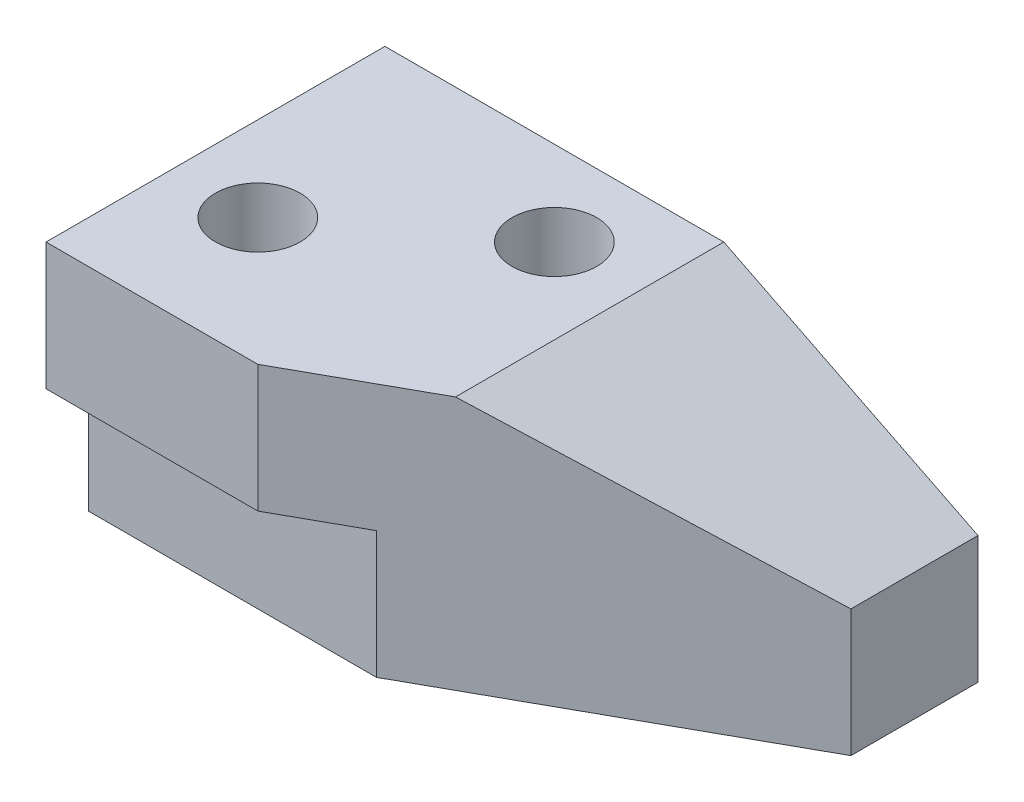
ISO-10303-21;
HEADER;
FILE_DESCRIPTION(('STEP AP214'),'2;1');
FILE_NAME('part.step','',(''),(''),'','','');
FILE_SCHEMA(('AUTOMOTIVE_DESIGN { 1 0 10303 214 1 1 1 1 }'));
ENDSEC;
DATA;
#1=APPLICATION_CONTEXT('core data for automotive mechanical design processes');
#2=APPLICATION_PROTOCOL_DEFINITION('international standard','automotive_design',2000,#1);
#3=PRODUCT_CONTEXT('',#1,'mechanical');
#4=PRODUCT('Part','Part','',(#3));
#5=PRODUCT_RELATED_PRODUCT_CATEGORY('part','',(#4));
#6=PRODUCT_DEFINITION_FORMATION('','',#4);
#7=PRODUCT_DEFINITION_CONTEXT('part definition',#1,'design');
#8=PRODUCT_DEFINITION('design','',#6,#7);
#9=PRODUCT_DEFINITION_SHAPE('','',#8);
#10=(LENGTH_UNIT() NAMED_UNIT(*) SI_UNIT(.MILLI.,.METRE.));
#11=(NAMED_UNIT(*) PLANE_ANGLE_UNIT() SI_UNIT($,.RADIAN.));
#12=(NAMED_UNIT(*) SI_UNIT($,.STERADIAN.) SOLID_ANGLE_UNIT());
#13=UNCERTAINTY_MEASURE_WITH_UNIT(LENGTH_MEASURE(1.E-05),#10,'distance_accuracy_value','');
#14=(GEOMETRIC_REPRESENTATION_CONTEXT(3) GLOBAL_UNCERTAINTY_ASSIGNED_CONTEXT((#13)) GLOBAL_UNIT_ASSIGNED_CONTEXT((#10,
#11,#12)) REPRESENTATION_CONTEXT('',''));
#15=CARTESIAN_POINT('',(0.,0.,0.));
#16=DIRECTION('',(0.,0.,1.));
#17=DIRECTION('',(1.,0.,0.));
#18=AXIS2_PLACEMENT_3D('',#15,#16,#17);
#19=CARTESIAN_POINT('',(0.,30.,0.));
#20=DIRECTION('',(1.,0.,0.));
#21=DIRECTION('',(0.,0.,-1.));
#22=AXIS2_PLACEMENT_3D('',#19,#20,#21);
#23=PLANE('',#22);
#24=DIRECTION('',(0.,0.,1.));
#25=VECTOR('',#24,1.);
#26=CARTESIAN_POINT('',(0.,0.,0.));
#27=LINE('',#26,#25);
#28=CARTESIAN_POINT('',(0.,0.,-40.));
#29=VERTEX_POINT('',#28);
#30=CARTESIAN_POINT('',(0.,0.,-5.));
#31=VERTEX_POINT('',#30);
#32=EDGE_CURVE('E162',#29,#31,#27,.T.);
#33=ORIENTED_EDGE('',*,*,#32,.T.);
#34=DIRECTION('',(0.,-1.,0.));
#35=VECTOR('',#34,1.);
#36=CARTESIAN_POINT('',(0.,0.,-5.));
#37=LINE('',#36,#35);
#38=CARTESIAN_POINT('',(0.,15.,-5.));
#39=VERTEX_POINT('',#38);
#40=EDGE_CURVE('E113',#39,#31,#37,.T.);
#41=ORIENTED_EDGE('',*,*,#40,.F.);
#42=DIRECTION('',(0.,0.,-1.));
#43=VECTOR('',#42,1.);
#44=CARTESIAN_POINT('',(0.,15.,0.));
#45=LINE('',#44,#43);
#46=CARTESIAN_POINT('',(0.,15.,0.));
#47=VERTEX_POINT('',#46);
#48=EDGE_CURVE('E105',#47,#39,#45,.T.);
#49=ORIENTED_EDGE('',*,*,#48,.F.);
#50=DIRECTION('',(0.,-1.,0.));
#51=VECTOR('',#50,1.);
#52=CARTESIAN_POINT('',(0.,30.,0.));
#53=LINE('',#52,#51);
#54=CARTESIAN_POINT('',(0.,30.,0.));
#55=VERTEX_POINT('',#54);
#56=EDGE_CURVE('E119',#55,#47,#53,.T.);
#57=ORIENTED_EDGE('',*,*,#56,.F.);
#58=DIRECTION('',(0.,0.,1.));
#59=VECTOR('',#58,1.);
#60=CARTESIAN_POINT('',(0.,30.,0.));
#61=LINE('',#60,#59);
#62=CARTESIAN_POINT('',(0.,30.,-40.));
#63=VERTEX_POINT('',#62);
#64=EDGE_CURVE('E166',#63,#55,#61,.T.);
#65=ORIENTED_EDGE('',*,*,#64,.F.);
#66=DIRECTION('',(0.,-1.,0.));
#67=VECTOR('',#66,1.);
#68=CARTESIAN_POINT('',(0.,30.,-40.));
#69=LINE('',#68,#67);
#70=EDGE_CURVE('E135',#63,#29,#69,.T.);
#71=ORIENTED_EDGE('',*,*,#70,.T.);
#72=EDGE_LOOP('',(#33,#41,#49,#57,#65,#71));
#73=FACE_BOUND('',#72,.T.);
#74=ADVANCED_FACE('F39',(#73),#23,.F.);
#75=CARTESIAN_POINT('',(0.,30.,0.));
#76=DIRECTION('',(0.,0.,-1.));
#77=DIRECTION('',(-1.,0.,0.));
#78=AXIS2_PLACEMENT_3D('',#75,#76,#77);
#79=PLANE('',#78);
#80=ORIENTED_EDGE('',*,*,#56,.T.);
#81=DIRECTION('',(-1.,0.,0.));
#82=VECTOR('',#81,1.);
#83=CARTESIAN_POINT('',(70.,15.,0.));
#84=LINE('',#83,#82);
#85=CARTESIAN_POINT('',(25.,15.,0.));
#86=VERTEX_POINT('',#85);
#87=EDGE_CURVE('E102',#86,#47,#84,.T.);
#88=ORIENTED_EDGE('',*,*,#87,.F.);
#89=DIRECTION('',(0.,-1.,0.));
#90=VECTOR('',#89,1.);
#91=CARTESIAN_POINT('',(25.,30.,0.));
#92=LINE('',#91,#90);
#93=CARTESIAN_POINT('',(25.,30.,0.));
#94=VERTEX_POINT('',#93);
#95=EDGE_CURVE('E141',#94,#86,#92,.T.);
#96=ORIENTED_EDGE('',*,*,#95,.F.);
#97=DIRECTION('',(1.,0.,0.));
#98=VECTOR('',#97,1.);
#99=CARTESIAN_POINT('',(0.,30.,0.));
#100=LINE('',#99,#98);
#101=EDGE_CURVE('E125',#55,#94,#100,.T.);
#102=ORIENTED_EDGE('',*,*,#101,.F.);
#103=EDGE_LOOP('',(#80,#88,#96,#102));
#104=FACE_BOUND('',#103,.T.);
#105=ADVANCED_FACE('F123',(#104),#79,.F.);
#106=CARTESIAN_POINT('',(70.,30.,0.));
#107=DIRECTION('',(-1.,0.,0.));
#108=DIRECTION('',(0.,0.,1.));
#109=AXIS2_PLACEMENT_3D('',#106,#107,#108);
#110=PLANE('',#109);
#111=DIRECTION('',(0.,0.,1.));
#112=VECTOR('',#111,1.);
#113=CARTESIAN_POINT('',(70.,15.,-40.));
#114=LINE('',#113,#112);
#115=CARTESIAN_POINT('',(70.,15.,-40.));
#116=VERTEX_POINT('',#115);
#117=CARTESIAN_POINT('',(70.,15.,-25.));
#118=VERTEX_POINT('',#117);
#119=EDGE_CURVE('E158',#116,#118,#114,.T.);
#120=ORIENTED_EDGE('',*,*,#119,.T.);
#121=DIRECTION('',(0.,-1.,0.));
#122=VECTOR('',#121,1.);
#123=CARTESIAN_POINT('',(70.,30.,-25.));
#124=LINE('',#123,#122);
#125=CARTESIAN_POINT('',(70.,0.,-25.));
#126=VERTEX_POINT('',#125);
#127=EDGE_CURVE('E62',#118,#126,#124,.T.);
#128=ORIENTED_EDGE('',*,*,#127,.T.);
#129=DIRECTION('',(0.,0.,-1.));
#130=VECTOR('',#129,1.);
#131=CARTESIAN_POINT('',(70.,0.,0.));
#132=LINE('',#131,#130);
#133=CARTESIAN_POINT('',(70.,0.,-40.));
#134=VERTEX_POINT('',#133);
#135=EDGE_CURVE('E177',#126,#134,#132,.T.);
#136=ORIENTED_EDGE('',*,*,#135,.T.);
#137=DIRECTION('',(0.,-1.,0.));
#138=VECTOR('',#137,1.);
#139=CARTESIAN_POINT('',(70.,30.,-40.));
#140=LINE('',#139,#138);
#141=EDGE_CURVE('E129',#116,#134,#140,.T.);
#142=ORIENTED_EDGE('',*,*,#141,.F.);
#143=EDGE_LOOP('',(#120,#128,#136,#142));
#144=FACE_BOUND('',#143,.T.);
#145=ADVANCED_FACE('F238',(#144),#110,.F.);
#146=CARTESIAN_POINT('',(0.,30.,-40.));
#147=DIRECTION('',(0.,0.,1.));
#148=DIRECTION('',(1.,0.,0.));
#149=AXIS2_PLACEMENT_3D('',#146,#147,#148);
#150=PLANE('',#149);
#151=DIRECTION('',(-1.,0.,0.));
#152=VECTOR('',#151,1.);
#153=CARTESIAN_POINT('',(0.,30.,-40.));
#154=LINE('',#153,#152);
#155=CARTESIAN_POINT('',(40.,30.,-40.));
#156=VERTEX_POINT('',#155);
#157=EDGE_CURVE('E172',#156,#63,#154,.T.);
#158=ORIENTED_EDGE('',*,*,#157,.F.);
#159=DIRECTION('',(0.894427190999916,-0.447213595499958,0.));
#160=VECTOR('',#159,1.);
#161=CARTESIAN_POINT('',(40.,30.,-40.));
#162=LINE('',#161,#160);
#163=EDGE_CURVE('E148',#156,#116,#162,.T.);
#164=ORIENTED_EDGE('',*,*,#163,.T.);
#165=ORIENTED_EDGE('',*,*,#141,.T.);
#166=DIRECTION('',(-1.,0.,0.));
#167=VECTOR('',#166,1.);
#168=CARTESIAN_POINT('',(0.,0.,-40.));
#169=LINE('',#168,#167);
#170=EDGE_CURVE('E169',#134,#29,#169,.T.);
#171=ORIENTED_EDGE('',*,*,#170,.T.);
#172=ORIENTED_EDGE('',*,*,#70,.F.);
#173=EDGE_LOOP('',(#158,#164,#165,#171,#172));
#174=FACE_BOUND('',#173,.T.);
#175=ADVANCED_FACE('F230',(#174),#150,.F.);
#176=CARTESIAN_POINT('',(0.,30.,0.));
#177=DIRECTION('',(0.,-1.,0.));
#178=DIRECTION('',(0.,0.,-1.));
#179=AXIS2_PLACEMENT_3D('',#176,#177,#178);
#180=PLANE('',#179);
#181=CARTESIAN_POINT('',(30.,30.,-30.));
#182=DIRECTION('',(0.,1.,0.));
#183=DIRECTION('',(0.,0.,1.));
#184=AXIS2_PLACEMENT_3D('',#181,#182,#183);
#185=CIRCLE('',#184,5.);
#186=CARTESIAN_POINT('',(30.,30.,-25.));
#187=VERTEX_POINT('',#186);
#188=EDGE_CURVE('E210',#187,#187,#185,.T.);
#189=ORIENTED_EDGE('',*,*,#188,.F.);
#190=EDGE_LOOP('',(#189));
#191=FACE_BOUND('',#190,.T.);
#192=CARTESIAN_POINT('',(10.,30.,-15.));
#193=DIRECTION('',(0.,1.,0.));
#194=DIRECTION('',(0.,0.,1.));
#195=AXIS2_PLACEMENT_3D('',#192,#193,#194);
#196=CIRCLE('',#195,5.);
#197=CARTESIAN_POINT('',(10.,30.,-10.));
#198=VERTEX_POINT('',#197);
#199=EDGE_CURVE('E202',#198,#198,#196,.T.);
#200=ORIENTED_EDGE('',*,*,#199,.F.);
#201=EDGE_LOOP('',(#200));
#202=FACE_BOUND('',#201,.T.);
#203=ORIENTED_EDGE('',*,*,#101,.T.);
#204=DIRECTION('',(0.874157276121538,0.,-0.485642931178632));
#205=VECTOR('',#204,1.);
#206=CARTESIAN_POINT('',(25.,30.,0.));
#207=LINE('',#206,#205);
#208=CARTESIAN_POINT('',(40.,30.,-8.33333333333334));
#209=VERTEX_POINT('',#208);
#210=EDGE_CURVE('E143',#94,#209,#207,.T.);
#211=ORIENTED_EDGE('',*,*,#210,.T.);
#212=DIRECTION('',(0.,0.,1.));
#213=VECTOR('',#212,1.);
#214=CARTESIAN_POINT('',(40.,30.,-40.));
#215=LINE('',#214,#213);
#216=EDGE_CURVE('E157',#156,#209,#215,.T.);
#217=ORIENTED_EDGE('',*,*,#216,.F.);
#218=ORIENTED_EDGE('',*,*,#157,.T.);
#219=ORIENTED_EDGE('',*,*,#64,.T.);
#220=EDGE_LOOP('',(#203,#211,#217,#218,#219));
#221=FACE_BOUND('',#220,.T.);
#222=ADVANCED_FACE('F227',(#191,#202,#221),#180,.F.);
#223=CARTESIAN_POINT('',(0.,0.,0.));
#224=DIRECTION('',(0.,-1.,0.));
#225=DIRECTION('',(0.,0.,-1.));
#226=AXIS2_PLACEMENT_3D('',#223,#224,#225);
#227=PLANE('',#226);
#228=CARTESIAN_POINT('',(30.,0.,-30.));
#229=DIRECTION('',(0.,1.,0.));
#230=DIRECTION('',(0.,0.,1.));
#231=AXIS2_PLACEMENT_3D('',#228,#229,#230);
#232=CIRCLE('',#231,5.);
#233=CARTESIAN_POINT('',(30.,0.,-25.));
#234=VERTEX_POINT('',#233);
#235=EDGE_CURVE('E206',#234,#234,#232,.T.);
#236=ORIENTED_EDGE('',*,*,#235,.T.);
#237=EDGE_LOOP('',(#236));
#238=FACE_BOUND('',#237,.T.);
#239=CARTESIAN_POINT('',(10.,0.,-15.));
#240=DIRECTION('',(0.,1.,0.));
#241=DIRECTION('',(0.,0.,1.));
#242=AXIS2_PLACEMENT_3D('',#239,#240,#241);
#243=CIRCLE('',#242,5.);
#244=CARTESIAN_POINT('',(10.,0.,-10.));
#245=VERTEX_POINT('',#244);
#246=EDGE_CURVE('E121',#245,#245,#243,.T.);
#247=ORIENTED_EDGE('',*,*,#246,.T.);
#248=EDGE_LOOP('',(#247));
#249=FACE_BOUND('',#248,.T.);
#250=DIRECTION('',(-1.,0.,0.));
#251=VECTOR('',#250,1.);
#252=CARTESIAN_POINT('',(70.,0.,-5.));
#253=LINE('',#252,#251);
#254=CARTESIAN_POINT('',(34.,0.,-5.));
#255=VERTEX_POINT('',#254);
#256=EDGE_CURVE('E192',#255,#31,#253,.T.);
#257=ORIENTED_EDGE('',*,*,#256,.T.);
#258=ORIENTED_EDGE('',*,*,#32,.F.);
#259=ORIENTED_EDGE('',*,*,#170,.F.);
#260=ORIENTED_EDGE('',*,*,#135,.F.);
#261=DIRECTION('',(0.874157276121538,0.,-0.485642931178632));
#262=VECTOR('',#261,1.);
#263=CARTESIAN_POINT('',(25.,0.,0.));
#264=LINE('',#263,#262);
#265=EDGE_CURVE('E150',#255,#126,#264,.T.);
#266=ORIENTED_EDGE('',*,*,#265,.F.);
#267=EDGE_LOOP('',(#257,#258,#259,#260,#266));
#268=FACE_BOUND('',#267,.T.);
#269=ADVANCED_FACE('F190',(#238,#249,#268),#227,.T.);
#270=CARTESIAN_POINT('',(40.,30.,-40.));
#271=DIRECTION('',(-0.447213595499958,-0.894427190999916,0.));
#272=DIRECTION('',(0.894427190999916,-0.447213595499958,0.));
#273=AXIS2_PLACEMENT_3D('',#270,#271,#272);
#274=PLANE('',#273);
#275=ORIENTED_EDGE('',*,*,#216,.T.);
#276=DIRECTION('',(0.800989487081973,-0.400494743540986,-0.444994159489985));
#277=VECTOR('',#276,1.);
#278=CARTESIAN_POINT('',(51.2871287128713,24.3564356435643,-14.6039603960396));
#279=LINE('',#278,#277);
#280=EDGE_CURVE('E128',#209,#118,#279,.T.);
#281=ORIENTED_EDGE('',*,*,#280,.T.);
#282=ORIENTED_EDGE('',*,*,#119,.F.);
#283=ORIENTED_EDGE('',*,*,#163,.F.);
#284=EDGE_LOOP('',(#275,#281,#282,#283));
#285=FACE_BOUND('',#284,.T.);
#286=ADVANCED_FACE('F239',(#285),#274,.F.);
#287=CARTESIAN_POINT('',(25.,30.,0.));
#288=DIRECTION('',(-0.485642931178632,0.,-0.874157276121538));
#289=DIRECTION('',(-0.874157276121538,0.,0.485642931178632));
#290=AXIS2_PLACEMENT_3D('',#287,#288,#289);
#291=PLANE('',#290);
#292=DIRECTION('',(0.874157276121538,0.,-0.485642931178632));
#293=VECTOR('',#292,1.);
#294=CARTESIAN_POINT('',(25.,15.,0.));
#295=LINE('',#294,#293);
#296=CARTESIAN_POINT('',(34.,15.,-5.));
#297=VERTEX_POINT('',#296);
#298=EDGE_CURVE('E47',#86,#297,#295,.T.);
#299=ORIENTED_EDGE('',*,*,#298,.T.);
#300=DIRECTION('',(0.,-1.,0.));
#301=VECTOR('',#300,1.);
#302=CARTESIAN_POINT('',(34.,30.,-5.));
#303=LINE('',#302,#301);
#304=EDGE_CURVE('E11',#297,#255,#303,.T.);
#305=ORIENTED_EDGE('',*,*,#304,.T.);
#306=ORIENTED_EDGE('',*,*,#265,.T.);
#307=ORIENTED_EDGE('',*,*,#127,.F.);
#308=ORIENTED_EDGE('',*,*,#280,.F.);
#309=ORIENTED_EDGE('',*,*,#210,.F.);
#310=ORIENTED_EDGE('',*,*,#95,.T.);
#311=EDGE_LOOP('',(#299,#305,#306,#307,#308,#309,#310));
#312=FACE_BOUND('',#311,.T.);
#313=ADVANCED_FACE('F139',(#312),#291,.F.);
#314=CARTESIAN_POINT('',(70.,0.,-5.));
#315=DIRECTION('',(0.,0.,-1.));
#316=DIRECTION('',(-1.,0.,0.));
#317=AXIS2_PLACEMENT_3D('',#314,#315,#316);
#318=PLANE('',#317);
#319=DIRECTION('',(-1.,0.,0.));
#320=VECTOR('',#319,1.);
#321=CARTESIAN_POINT('',(70.,15.,-5.));
#322=LINE('',#321,#320);
#323=EDGE_CURVE('E54',#297,#39,#322,.T.);
#324=ORIENTED_EDGE('',*,*,#323,.T.);
#325=ORIENTED_EDGE('',*,*,#40,.T.);
#326=ORIENTED_EDGE('',*,*,#256,.F.);
#327=ORIENTED_EDGE('',*,*,#304,.F.);
#328=EDGE_LOOP('',(#324,#325,#326,#327));
#329=FACE_BOUND('',#328,.T.);
#330=ADVANCED_FACE('F246',(#329),#318,.F.);
#331=CARTESIAN_POINT('',(70.,15.,0.));
#332=DIRECTION('',(0.,1.,0.));
#333=DIRECTION('',(0.,0.,1.));
#334=AXIS2_PLACEMENT_3D('',#331,#332,#333);
#335=PLANE('',#334);
#336=ORIENTED_EDGE('',*,*,#87,.T.);
#337=ORIENTED_EDGE('',*,*,#48,.T.);
#338=ORIENTED_EDGE('',*,*,#323,.F.);
#339=ORIENTED_EDGE('',*,*,#298,.F.);
#340=EDGE_LOOP('',(#336,#337,#338,#339));
#341=FACE_BOUND('',#340,.T.);
#342=ADVANCED_FACE('F104',(#341),#335,.F.);
#343=CARTESIAN_POINT('',(10.,0.,-15.));
#344=DIRECTION('',(0.,1.,0.));
#345=DIRECTION('',(0.,0.,1.));
#346=AXIS2_PLACEMENT_3D('',#343,#344,#345);
#347=CYLINDRICAL_SURFACE('',#346,5.);
#348=ORIENTED_EDGE('',*,*,#246,.F.);
#349=EDGE_LOOP('',(#348));
#350=FACE_BOUND('',#349,.T.);
#351=ORIENTED_EDGE('',*,*,#199,.T.);
#352=EDGE_LOOP('',(#351));
#353=FACE_BOUND('',#352,.T.);
#354=ADVANCED_FACE('F223',(#350,#353),#347,.F.);
#355=CARTESIAN_POINT('',(30.,0.,-30.));
#356=DIRECTION('',(0.,1.,0.));
#357=DIRECTION('',(0.,0.,1.));
#358=AXIS2_PLACEMENT_3D('',#355,#356,#357);
#359=CYLINDRICAL_SURFACE('',#358,5.);
#360=ORIENTED_EDGE('',*,*,#235,.F.);
#361=EDGE_LOOP('',(#360));
#362=FACE_BOUND('',#361,.T.);
#363=ORIENTED_EDGE('',*,*,#188,.T.);
#364=EDGE_LOOP('',(#363));
#365=FACE_BOUND('',#364,.T.);
#366=ADVANCED_FACE('F220',(#362,#365),#359,.F.);
#367=CLOSED_SHELL('',(#74,#105,#145,#175,#222,#269,#286,#313,#330,#342,#354,#366));
#368=MANIFOLD_SOLID_BREP('B2',#367);
#369=ADVANCED_BREP_SHAPE_REPRESENTATION('',(#18,#368),#14);
#370=SHAPE_DEFINITION_REPRESENTATION(#9,#369);
ENDSEC;
END-ISO-10303-21;
